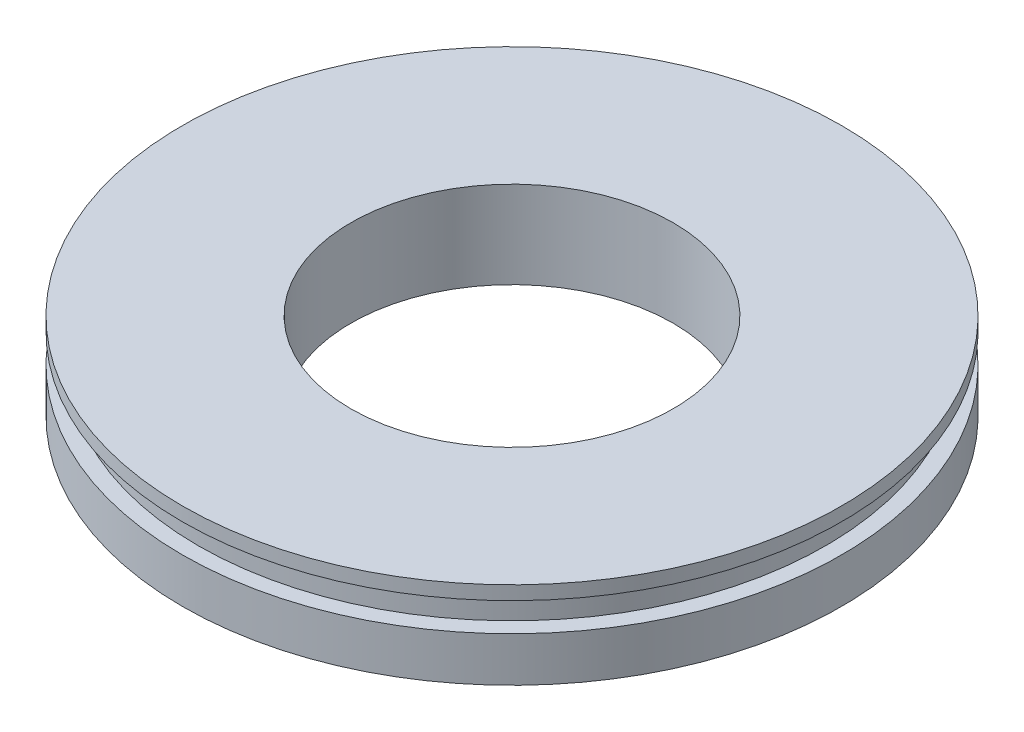
ISO-10303-21;
HEADER;
FILE_DESCRIPTION(('STEP AP214'),'2;1');
FILE_NAME('part.step','',(''),(''),'','','');
FILE_SCHEMA(('AUTOMOTIVE_DESIGN { 1 0 10303 214 1 1 1 1 }'));
ENDSEC;
DATA;
#1=APPLICATION_CONTEXT('core data for automotive mechanical design processes');
#2=APPLICATION_PROTOCOL_DEFINITION('international standard','automotive_design',2000,#1);
#3=PRODUCT_CONTEXT('',#1,'mechanical');
#4=PRODUCT('Part','Part','',(#3));
#5=PRODUCT_RELATED_PRODUCT_CATEGORY('part','',(#4));
#6=PRODUCT_DEFINITION_FORMATION('','',#4);
#7=PRODUCT_DEFINITION_CONTEXT('part definition',#1,'design');
#8=PRODUCT_DEFINITION('design','',#6,#7);
#9=PRODUCT_DEFINITION_SHAPE('','',#8);
#10=(LENGTH_UNIT() NAMED_UNIT(*) SI_UNIT(.MILLI.,.METRE.));
#11=(NAMED_UNIT(*) PLANE_ANGLE_UNIT() SI_UNIT($,.RADIAN.));
#12=(NAMED_UNIT(*) SI_UNIT($,.STERADIAN.) SOLID_ANGLE_UNIT());
#13=UNCERTAINTY_MEASURE_WITH_UNIT(LENGTH_MEASURE(1.E-05),#10,'distance_accuracy_value','');
#14=(GEOMETRIC_REPRESENTATION_CONTEXT(3) GLOBAL_UNCERTAINTY_ASSIGNED_CONTEXT((#13)) GLOBAL_UNIT_ASSIGNED_CONTEXT((#10,
#11,#12)) REPRESENTATION_CONTEXT('',''));
#15=CARTESIAN_POINT('',(0.,0.,0.));
#16=DIRECTION('',(0.,0.,1.));
#17=DIRECTION('',(1.,0.,0.));
#18=AXIS2_PLACEMENT_3D('',#15,#16,#17);
#19=CARTESIAN_POINT('',(0.,2.69408399999995,29.21));
#20=DIRECTION('',(0.,1.,0.));
#21=DIRECTION('',(0.,0.,1.));
#22=AXIS2_PLACEMENT_3D('',#19,#20,#21);
#23=PLANE('',#22);
#24=CARTESIAN_POINT('',(0.,2.69408399999995,0.));
#25=DIRECTION('',(0.,1.,0.));
#26=DIRECTION('',(0.,0.,1.));
#27=AXIS2_PLACEMENT_3D('',#24,#25,#26);
#28=CIRCLE('',#27,29.21);
#29=CARTESIAN_POINT('',(0.,2.69408399999995,29.21));
#30=VERTEX_POINT('',#29);
#31=EDGE_CURVE('E60',#30,#30,#28,.T.);
#32=ORIENTED_EDGE('',*,*,#31,.T.);
#33=EDGE_LOOP('',(#32));
#34=FACE_BOUND('',#33,.T.);
#35=CARTESIAN_POINT('',(0.,2.69408399999995,0.));
#36=DIRECTION('',(0.,1.,0.));
#37=DIRECTION('',(0.,0.,1.));
#38=AXIS2_PLACEMENT_3D('',#35,#36,#37);
#39=CIRCLE('',#38,14.2875);
#40=CARTESIAN_POINT('',(0.,2.69408399999995,14.2875));
#41=VERTEX_POINT('',#40);
#42=EDGE_CURVE('E10',#41,#41,#39,.T.);
#43=ORIENTED_EDGE('',*,*,#42,.F.);
#44=EDGE_LOOP('',(#43));
#45=FACE_BOUND('',#44,.T.);
#46=ADVANCED_FACE('F32',(#34,#45),#23,.T.);
#47=CARTESIAN_POINT('',(0.,0.,0.));
#48=DIRECTION('',(0.,1.,0.));
#49=DIRECTION('',(0.,0.,1.));
#50=AXIS2_PLACEMENT_3D('',#47,#48,#49);
#51=CYLINDRICAL_SURFACE('',#50,14.2875);
#52=ORIENTED_EDGE('',*,*,#42,.T.);
#53=EDGE_LOOP('',(#52));
#54=FACE_BOUND('',#53,.T.);
#55=CARTESIAN_POINT('',(0.,-5.02081799999997,0.));
#56=DIRECTION('',(0.,1.,0.));
#57=DIRECTION('',(0.,0.,1.));
#58=AXIS2_PLACEMENT_3D('',#55,#56,#57);
#59=CIRCLE('',#58,14.2875);
#60=CARTESIAN_POINT('',(0.,-5.02081799999997,14.2875));
#61=VERTEX_POINT('',#60);
#62=EDGE_CURVE('E38',#61,#61,#59,.T.);
#63=ORIENTED_EDGE('',*,*,#62,.F.);
#64=EDGE_LOOP('',(#63));
#65=FACE_BOUND('',#64,.T.);
#66=ADVANCED_FACE('F78',(#54,#65),#51,.F.);
#67=CARTESIAN_POINT('',(0.,-5.02081799999997,14.2875));
#68=DIRECTION('',(0.,-1.,0.));
#69=DIRECTION('',(0.,0.,-1.));
#70=AXIS2_PLACEMENT_3D('',#67,#68,#69);
#71=PLANE('',#70);
#72=ORIENTED_EDGE('',*,*,#62,.T.);
#73=EDGE_LOOP('',(#72));
#74=FACE_BOUND('',#73,.T.);
#75=CARTESIAN_POINT('',(0.,-5.02081799999997,0.));
#76=DIRECTION('',(0.,1.,0.));
#77=DIRECTION('',(0.,0.,1.));
#78=AXIS2_PLACEMENT_3D('',#75,#76,#77);
#79=CIRCLE('',#78,29.21);
#80=CARTESIAN_POINT('',(0.,-5.02081799999997,29.21));
#81=VERTEX_POINT('',#80);
#82=EDGE_CURVE('E42',#81,#81,#79,.T.);
#83=ORIENTED_EDGE('',*,*,#82,.F.);
#84=EDGE_LOOP('',(#83));
#85=FACE_BOUND('',#84,.T.);
#86=ADVANCED_FACE('F82',(#74,#85),#71,.T.);
#87=CARTESIAN_POINT('',(0.,0.,0.));
#88=DIRECTION('',(0.,1.,0.));
#89=DIRECTION('',(0.,0.,1.));
#90=AXIS2_PLACEMENT_3D('',#87,#88,#89);
#91=CYLINDRICAL_SURFACE('',#90,29.21);
#92=ORIENTED_EDGE('',*,*,#82,.T.);
#93=EDGE_LOOP('',(#92));
#94=FACE_BOUND('',#93,.T.);
#95=CARTESIAN_POINT('',(0.,-1.06206800000024,0.));
#96=DIRECTION('',(0.,1.,0.));
#97=DIRECTION('',(0.,0.,1.));
#98=AXIS2_PLACEMENT_3D('',#95,#96,#97);
#99=CIRCLE('',#98,29.21);
#100=CARTESIAN_POINT('',(0.,-1.06206800000024,29.21));
#101=VERTEX_POINT('',#100);
#102=EDGE_CURVE('E46',#101,#101,#99,.T.);
#103=ORIENTED_EDGE('',*,*,#102,.F.);
#104=EDGE_LOOP('',(#103));
#105=FACE_BOUND('',#104,.T.);
#106=ADVANCED_FACE('F86',(#94,#105),#91,.T.);
#107=CARTESIAN_POINT('',(0.,-1.06206800000024,29.21));
#108=DIRECTION('',(0.,1.,0.));
#109=DIRECTION('',(0.,0.,1.));
#110=AXIS2_PLACEMENT_3D('',#107,#108,#109);
#111=PLANE('',#110);
#112=ORIENTED_EDGE('',*,*,#102,.T.);
#113=EDGE_LOOP('',(#112));
#114=FACE_BOUND('',#113,.T.);
#115=CARTESIAN_POINT('',(0.,-1.06206800000024,0.));
#116=DIRECTION('',(0.,1.,0.));
#117=DIRECTION('',(0.,0.,1.));
#118=AXIS2_PLACEMENT_3D('',#115,#116,#117);
#119=CIRCLE('',#118,27.80411);
#120=CARTESIAN_POINT('',(0.,-1.06206800000024,27.80411));
#121=VERTEX_POINT('',#120);
#122=EDGE_CURVE('E51',#121,#121,#119,.T.);
#123=ORIENTED_EDGE('',*,*,#122,.F.);
#124=EDGE_LOOP('',(#123));
#125=FACE_BOUND('',#124,.T.);
#126=ADVANCED_FACE('F92',(#114,#125),#111,.T.);
#127=CARTESIAN_POINT('',(0.,0.,0.));
#128=DIRECTION('',(0.,1.,0.));
#129=DIRECTION('',(0.,0.,1.));
#130=AXIS2_PLACEMENT_3D('',#127,#128,#129);
#131=CYLINDRICAL_SURFACE('',#130,27.80411);
#132=ORIENTED_EDGE('',*,*,#122,.T.);
#133=EDGE_LOOP('',(#132));
#134=FACE_BOUND('',#133,.T.);
#135=CARTESIAN_POINT('',(0.,1.47793199999976,0.));
#136=DIRECTION('',(0.,1.,0.));
#137=DIRECTION('',(0.,0.,1.));
#138=AXIS2_PLACEMENT_3D('',#135,#136,#137);
#139=CIRCLE('',#138,27.80411);
#140=CARTESIAN_POINT('',(0.,1.47793199999976,27.80411));
#141=VERTEX_POINT('',#140);
#142=EDGE_CURVE('E54',#141,#141,#139,.T.);
#143=ORIENTED_EDGE('',*,*,#142,.F.);
#144=EDGE_LOOP('',(#143));
#145=FACE_BOUND('',#144,.T.);
#146=ADVANCED_FACE('F74',(#134,#145),#131,.T.);
#147=CARTESIAN_POINT('',(0.,1.47793199999976,27.80411));
#148=DIRECTION('',(0.,-1.,0.));
#149=DIRECTION('',(0.,0.,-1.));
#150=AXIS2_PLACEMENT_3D('',#147,#148,#149);
#151=PLANE('',#150);
#152=ORIENTED_EDGE('',*,*,#142,.T.);
#153=EDGE_LOOP('',(#152));
#154=FACE_BOUND('',#153,.T.);
#155=CARTESIAN_POINT('',(0.,1.47793199999976,0.));
#156=DIRECTION('',(0.,1.,0.));
#157=DIRECTION('',(0.,0.,1.));
#158=AXIS2_PLACEMENT_3D('',#155,#156,#157);
#159=CIRCLE('',#158,29.21);
#160=CARTESIAN_POINT('',(0.,1.47793199999976,29.21));
#161=VERTEX_POINT('',#160);
#162=EDGE_CURVE('E57',#161,#161,#159,.T.);
#163=ORIENTED_EDGE('',*,*,#162,.F.);
#164=EDGE_LOOP('',(#163));
#165=FACE_BOUND('',#164,.T.);
#166=ADVANCED_FACE('F68',(#154,#165),#151,.T.);
#167=CARTESIAN_POINT('',(0.,0.,0.));
#168=DIRECTION('',(0.,1.,0.));
#169=DIRECTION('',(0.,0.,1.));
#170=AXIS2_PLACEMENT_3D('',#167,#168,#169);
#171=CYLINDRICAL_SURFACE('',#170,29.21);
#172=ORIENTED_EDGE('',*,*,#162,.T.);
#173=EDGE_LOOP('',(#172));
#174=FACE_BOUND('',#173,.T.);
#175=ORIENTED_EDGE('',*,*,#31,.F.);
#176=EDGE_LOOP('',(#175));
#177=FACE_BOUND('',#176,.T.);
#178=ADVANCED_FACE('F66',(#174,#177),#171,.T.);
#179=CLOSED_SHELL('',(#46,#66,#86,#106,#126,#146,#166,#178));
#180=MANIFOLD_SOLID_BREP('B2',#179);
#181=ADVANCED_BREP_SHAPE_REPRESENTATION('',(#18,#180),#14);
#182=SHAPE_DEFINITION_REPRESENTATION(#9,#181);
ENDSEC;
END-ISO-10303-21;
